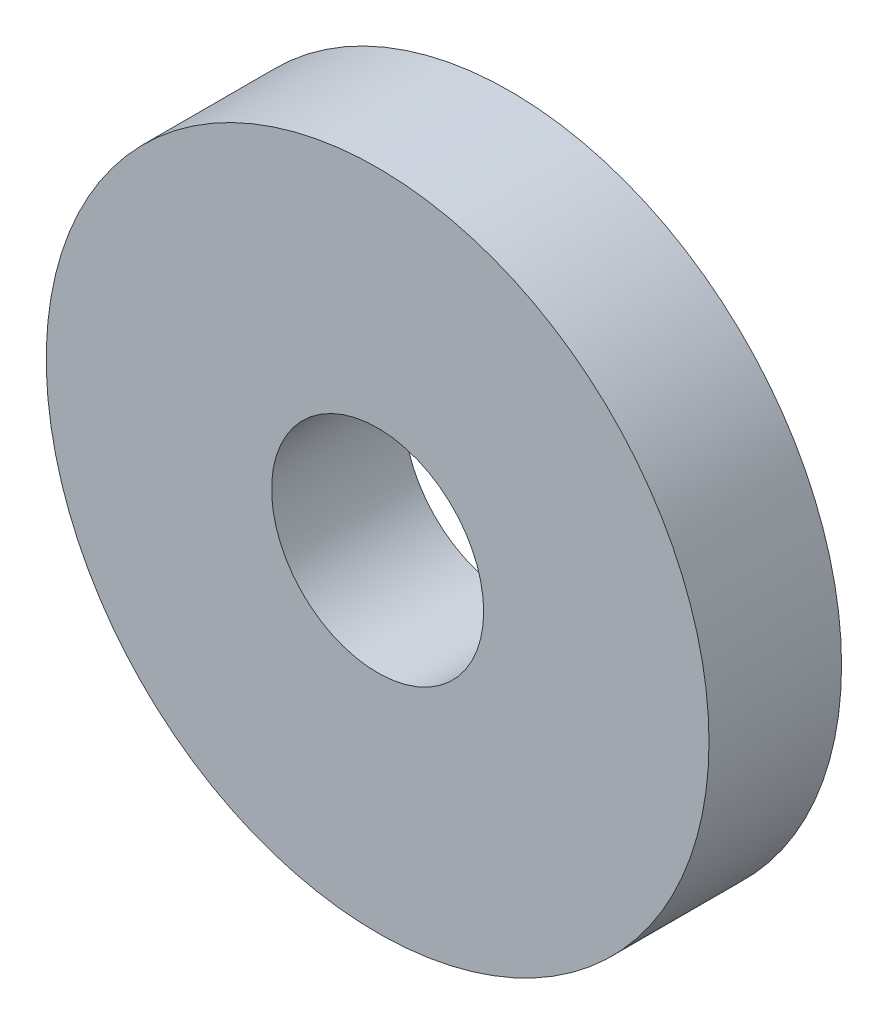
ISO-10303-21;
HEADER;
FILE_DESCRIPTION(('STEP AP214'),'2;1');
FILE_NAME('part.step','',(''),(''),'','','');
FILE_SCHEMA(('AUTOMOTIVE_DESIGN { 1 0 10303 214 1 1 1 1 }'));
ENDSEC;
DATA;
#1=APPLICATION_CONTEXT('core data for automotive mechanical design processes');
#2=APPLICATION_PROTOCOL_DEFINITION('international standard','automotive_design',2000,#1);
#3=PRODUCT_CONTEXT('',#1,'mechanical');
#4=PRODUCT('Part','Part','',(#3));
#5=PRODUCT_RELATED_PRODUCT_CATEGORY('part','',(#4));
#6=PRODUCT_DEFINITION_FORMATION('','',#4);
#7=PRODUCT_DEFINITION_CONTEXT('part definition',#1,'design');
#8=PRODUCT_DEFINITION('design','',#6,#7);
#9=PRODUCT_DEFINITION_SHAPE('','',#8);
#10=(LENGTH_UNIT() NAMED_UNIT(*) SI_UNIT(.MILLI.,.METRE.));
#11=(NAMED_UNIT(*) PLANE_ANGLE_UNIT() SI_UNIT($,.RADIAN.));
#12=(NAMED_UNIT(*) SI_UNIT($,.STERADIAN.) SOLID_ANGLE_UNIT());
#13=UNCERTAINTY_MEASURE_WITH_UNIT(LENGTH_MEASURE(1.E-05),#10,'distance_accuracy_value','');
#14=(GEOMETRIC_REPRESENTATION_CONTEXT(3) GLOBAL_UNCERTAINTY_ASSIGNED_CONTEXT((#13)) GLOBAL_UNIT_ASSIGNED_CONTEXT((#10,
#11,#12)) REPRESENTATION_CONTEXT('',''));
#15=CARTESIAN_POINT('',(0.,0.,0.));
#16=DIRECTION('',(0.,0.,1.));
#17=DIRECTION('',(1.,0.,0.));
#18=AXIS2_PLACEMENT_3D('',#15,#16,#17);
#19=CARTESIAN_POINT('',(0.,0.,2.));
#20=DIRECTION('',(0.,0.,1.));
#21=DIRECTION('',(1.,0.,0.));
#22=AXIS2_PLACEMENT_3D('',#19,#20,#21);
#23=PLANE('',#22);
#24=CARTESIAN_POINT('',(0.,0.,2.));
#25=DIRECTION('',(0.,0.,1.));
#26=DIRECTION('',(1.,0.,0.));
#27=AXIS2_PLACEMENT_3D('',#24,#25,#26);
#28=CIRCLE('',#27,5.);
#29=CARTESIAN_POINT('',(5.,0.,2.));
#30=VERTEX_POINT('',#29);
#31=EDGE_CURVE('E11',#30,#30,#28,.T.);
#32=ORIENTED_EDGE('',*,*,#31,.T.);
#33=EDGE_LOOP('',(#32));
#34=FACE_BOUND('',#33,.T.);
#35=CARTESIAN_POINT('',(0.,0.,2.));
#36=DIRECTION('',(0.,0.,1.));
#37=DIRECTION('',(1.,0.,0.));
#38=AXIS2_PLACEMENT_3D('',#35,#36,#37);
#39=CIRCLE('',#38,1.6);
#40=CARTESIAN_POINT('',(1.6,0.,2.));
#41=VERTEX_POINT('',#40);
#42=EDGE_CURVE('E51',#41,#41,#39,.T.);
#43=ORIENTED_EDGE('',*,*,#42,.F.);
#44=EDGE_LOOP('',(#43));
#45=FACE_BOUND('',#44,.T.);
#46=ADVANCED_FACE('F38',(#34,#45),#23,.T.);
#47=CARTESIAN_POINT('',(0.,0.,0.));
#48=DIRECTION('',(0.,0.,1.));
#49=DIRECTION('',(1.,0.,0.));
#50=AXIS2_PLACEMENT_3D('',#47,#48,#49);
#51=PLANE('',#50);
#52=CARTESIAN_POINT('',(0.,0.,0.));
#53=DIRECTION('',(0.,0.,1.));
#54=DIRECTION('',(1.,0.,0.));
#55=AXIS2_PLACEMENT_3D('',#52,#53,#54);
#56=CIRCLE('',#55,5.);
#57=CARTESIAN_POINT('',(5.,0.,0.));
#58=VERTEX_POINT('',#57);
#59=EDGE_CURVE('E42',#58,#58,#56,.T.);
#60=ORIENTED_EDGE('',*,*,#59,.F.);
#61=EDGE_LOOP('',(#60));
#62=FACE_BOUND('',#61,.T.);
#63=CARTESIAN_POINT('',(0.,0.,0.));
#64=DIRECTION('',(0.,0.,1.));
#65=DIRECTION('',(1.,0.,0.));
#66=AXIS2_PLACEMENT_3D('',#63,#64,#65);
#67=CIRCLE('',#66,1.6);
#68=CARTESIAN_POINT('',(1.6,0.,0.));
#69=VERTEX_POINT('',#68);
#70=EDGE_CURVE('E54',#69,#69,#67,.T.);
#71=ORIENTED_EDGE('',*,*,#70,.T.);
#72=EDGE_LOOP('',(#71));
#73=FACE_BOUND('',#72,.T.);
#74=ADVANCED_FACE('F64',(#62,#73),#51,.F.);
#75=CARTESIAN_POINT('',(0.,0.,2.));
#76=DIRECTION('',(0.,0.,-1.));
#77=DIRECTION('',(-1.,0.,0.));
#78=AXIS2_PLACEMENT_3D('',#75,#76,#77);
#79=CYLINDRICAL_SURFACE('',#78,5.);
#80=ORIENTED_EDGE('',*,*,#31,.F.);
#81=EDGE_LOOP('',(#80));
#82=FACE_BOUND('',#81,.T.);
#83=ORIENTED_EDGE('',*,*,#59,.T.);
#84=EDGE_LOOP('',(#83));
#85=FACE_BOUND('',#84,.T.);
#86=ADVANCED_FACE('F40',(#82,#85),#79,.T.);
#87=CARTESIAN_POINT('',(0.,0.,2.));
#88=DIRECTION('',(0.,0.,-1.));
#89=DIRECTION('',(-1.,0.,0.));
#90=AXIS2_PLACEMENT_3D('',#87,#88,#89);
#91=CYLINDRICAL_SURFACE('',#90,1.6);
#92=ORIENTED_EDGE('',*,*,#42,.T.);
#93=EDGE_LOOP('',(#92));
#94=FACE_BOUND('',#93,.T.);
#95=ORIENTED_EDGE('',*,*,#70,.F.);
#96=EDGE_LOOP('',(#95));
#97=FACE_BOUND('',#96,.T.);
#98=ADVANCED_FACE('F60',(#94,#97),#91,.F.);
#99=CLOSED_SHELL('',(#46,#74,#86,#98));
#100=MANIFOLD_SOLID_BREP('B2',#99);
#101=ADVANCED_BREP_SHAPE_REPRESENTATION('',(#18,#100),#14);
#102=SHAPE_DEFINITION_REPRESENTATION(#9,#101);
ENDSEC;
END-ISO-10303-21;
